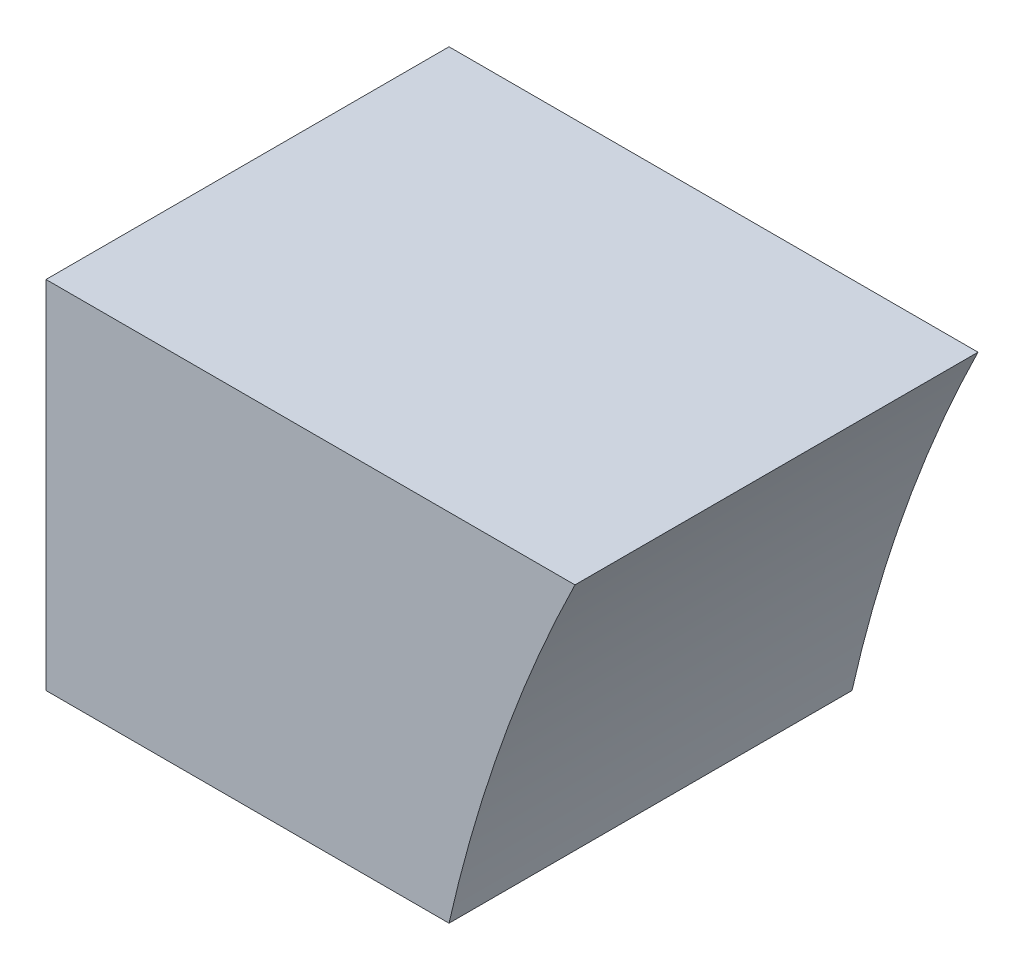
ISO-10303-21;
HEADER;
FILE_DESCRIPTION(('STEP AP214'),'2;1');
FILE_NAME('part.step','',(''),(''),'','','');
FILE_SCHEMA(('AUTOMOTIVE_DESIGN { 1 0 10303 214 1 1 1 1 }'));
ENDSEC;
DATA;
#1=APPLICATION_CONTEXT('core data for automotive mechanical design processes');
#2=APPLICATION_PROTOCOL_DEFINITION('international standard','automotive_design',2000,#1);
#3=PRODUCT_CONTEXT('',#1,'mechanical');
#4=PRODUCT('Part','Part','',(#3));
#5=PRODUCT_RELATED_PRODUCT_CATEGORY('part','',(#4));
#6=PRODUCT_DEFINITION_FORMATION('','',#4);
#7=PRODUCT_DEFINITION_CONTEXT('part definition',#1,'design');
#8=PRODUCT_DEFINITION('design','',#6,#7);
#9=PRODUCT_DEFINITION_SHAPE('','',#8);
#10=(LENGTH_UNIT() NAMED_UNIT(*) SI_UNIT(.MILLI.,.METRE.));
#11=(NAMED_UNIT(*) PLANE_ANGLE_UNIT() SI_UNIT($,.RADIAN.));
#12=(NAMED_UNIT(*) SI_UNIT($,.STERADIAN.) SOLID_ANGLE_UNIT());
#13=UNCERTAINTY_MEASURE_WITH_UNIT(LENGTH_MEASURE(1.E-05),#10,'distance_accuracy_value','');
#14=(GEOMETRIC_REPRESENTATION_CONTEXT(3) GLOBAL_UNCERTAINTY_ASSIGNED_CONTEXT((#13)) GLOBAL_UNIT_ASSIGNED_CONTEXT((#10,
#11,#12)) REPRESENTATION_CONTEXT('',''));
#15=CARTESIAN_POINT('',(0.,0.,0.));
#16=DIRECTION('',(0.,0.,1.));
#17=DIRECTION('',(1.,0.,0.));
#18=AXIS2_PLACEMENT_3D('',#15,#16,#17);
#19=CARTESIAN_POINT('',(-8112.,4992.,624.));
#20=DIRECTION('',(0.,0.,-1.));
#21=DIRECTION('',(-1.,0.,0.));
#22=AXIS2_PLACEMENT_3D('',#19,#20,#21);
#23=CYLINDRICAL_SURFACE('',#22,2496.);
#24=CARTESIAN_POINT('',(-8112.,4992.,0.));
#25=DIRECTION('',(0.,0.,1.));
#26=DIRECTION('',(1.,0.,0.));
#27=AXIS2_PLACEMENT_3D('',#24,#25,#26);
#28=CIRCLE('',#27,2496.);
#29=CARTESIAN_POINT('',(-10351.3593369533,6094.4,0.));
#30=VERTEX_POINT('',#29);
#31=CARTESIAN_POINT('',(-10546.3776535287,5543.2,0.));
#32=VERTEX_POINT('',#31);
#33=EDGE_CURVE('E100',#30,#32,#28,.T.);
#34=ORIENTED_EDGE('',*,*,#33,.F.);
#35=DIRECTION('',(0.,0.,-1.));
#36=VECTOR('',#35,1.);
#37=CARTESIAN_POINT('',(-10351.3593369533,6094.4,624.));
#38=LINE('',#37,#36);
#39=CARTESIAN_POINT('',(-10351.3593369533,6094.4,624.));
#40=VERTEX_POINT('',#39);
#41=EDGE_CURVE('E11',#40,#30,#38,.T.);
#42=ORIENTED_EDGE('',*,*,#41,.F.);
#43=CARTESIAN_POINT('',(-8112.,4992.,624.));
#44=DIRECTION('',(0.,0.,1.));
#45=DIRECTION('',(1.,0.,0.));
#46=AXIS2_PLACEMENT_3D('',#43,#44,#45);
#47=CIRCLE('',#46,2496.);
#48=CARTESIAN_POINT('',(-10546.3776535287,5543.2,624.));
#49=VERTEX_POINT('',#48);
#50=EDGE_CURVE('E93',#40,#49,#47,.T.);
#51=ORIENTED_EDGE('',*,*,#50,.T.);
#52=DIRECTION('',(0.,0.,-1.));
#53=VECTOR('',#52,1.);
#54=CARTESIAN_POINT('',(-10546.3776535287,5543.2,624.));
#55=LINE('',#54,#53);
#56=EDGE_CURVE('E75',#49,#32,#55,.T.);
#57=ORIENTED_EDGE('',*,*,#56,.T.);
#58=EDGE_LOOP('',(#34,#42,#51,#57));
#59=FACE_BOUND('',#58,.T.);
#60=ADVANCED_FACE('F37',(#59),#23,.F.);
#61=CARTESIAN_POINT('',(0.,6094.4,624.));
#62=DIRECTION('',(0.,1.,0.));
#63=DIRECTION('',(0.,0.,1.));
#64=AXIS2_PLACEMENT_3D('',#61,#62,#63);
#65=PLANE('',#64);
#66=DIRECTION('',(1.,0.,0.));
#67=VECTOR('',#66,1.);
#68=CARTESIAN_POINT('',(0.,6094.4,0.));
#69=LINE('',#68,#67);
#70=CARTESIAN_POINT('',(-11170.3776535287,6094.4,0.));
#71=VERTEX_POINT('',#70);
#72=EDGE_CURVE('E86',#71,#30,#69,.T.);
#73=ORIENTED_EDGE('',*,*,#72,.F.);
#74=DIRECTION('',(0.,0.,-1.));
#75=VECTOR('',#74,1.);
#76=CARTESIAN_POINT('',(-11170.3776535287,6094.4,624.));
#77=LINE('',#76,#75);
#78=CARTESIAN_POINT('',(-11170.3776535287,6094.4,624.));
#79=VERTEX_POINT('',#78);
#80=EDGE_CURVE('E45',#79,#71,#77,.T.);
#81=ORIENTED_EDGE('',*,*,#80,.F.);
#82=DIRECTION('',(1.,0.,0.));
#83=VECTOR('',#82,1.);
#84=CARTESIAN_POINT('',(0.,6094.4,624.));
#85=LINE('',#84,#83);
#86=EDGE_CURVE('E84',#79,#40,#85,.T.);
#87=ORIENTED_EDGE('',*,*,#86,.T.);
#88=ORIENTED_EDGE('',*,*,#41,.T.);
#89=EDGE_LOOP('',(#73,#81,#87,#88));
#90=FACE_BOUND('',#89,.T.);
#91=ADVANCED_FACE('F83',(#90),#65,.T.);
#92=CARTESIAN_POINT('',(-11170.3776535287,0.,624.));
#93=DIRECTION('',(-1.,0.,0.));
#94=DIRECTION('',(0.,0.,1.));
#95=AXIS2_PLACEMENT_3D('',#92,#93,#94);
#96=PLANE('',#95);
#97=DIRECTION('',(0.,1.,0.));
#98=VECTOR('',#97,1.);
#99=CARTESIAN_POINT('',(-11170.3776535287,0.,0.));
#100=LINE('',#99,#98);
#101=CARTESIAN_POINT('',(-11170.3776535287,5543.2,0.));
#102=VERTEX_POINT('',#101);
#103=EDGE_CURVE('E104',#102,#71,#100,.T.);
#104=ORIENTED_EDGE('',*,*,#103,.F.);
#105=DIRECTION('',(0.,0.,-1.));
#106=VECTOR('',#105,1.);
#107=CARTESIAN_POINT('',(-11170.3776535287,5543.2,624.));
#108=LINE('',#107,#106);
#109=CARTESIAN_POINT('',(-11170.3776535287,5543.2,624.));
#110=VERTEX_POINT('',#109);
#111=EDGE_CURVE('E68',#110,#102,#108,.T.);
#112=ORIENTED_EDGE('',*,*,#111,.F.);
#113=DIRECTION('',(0.,1.,0.));
#114=VECTOR('',#113,1.);
#115=CARTESIAN_POINT('',(-11170.3776535287,0.,624.));
#116=LINE('',#115,#114);
#117=EDGE_CURVE('E92',#110,#79,#116,.T.);
#118=ORIENTED_EDGE('',*,*,#117,.T.);
#119=ORIENTED_EDGE('',*,*,#80,.T.);
#120=EDGE_LOOP('',(#104,#112,#118,#119));
#121=FACE_BOUND('',#120,.T.);
#122=ADVANCED_FACE('F95',(#121),#96,.T.);
#123=CARTESIAN_POINT('',(0.,5543.2,624.));
#124=DIRECTION('',(0.,1.,0.));
#125=DIRECTION('',(0.,0.,1.));
#126=AXIS2_PLACEMENT_3D('',#123,#124,#125);
#127=PLANE('',#126);
#128=DIRECTION('',(1.,0.,0.));
#129=VECTOR('',#128,1.);
#130=CARTESIAN_POINT('',(0.,5543.2,0.));
#131=LINE('',#130,#129);
#132=EDGE_CURVE('E106',#102,#32,#131,.T.);
#133=ORIENTED_EDGE('',*,*,#132,.T.);
#134=ORIENTED_EDGE('',*,*,#56,.F.);
#135=DIRECTION('',(1.,0.,0.));
#136=VECTOR('',#135,1.);
#137=CARTESIAN_POINT('',(0.,5543.2,624.));
#138=LINE('',#137,#136);
#139=EDGE_CURVE('E53',#110,#49,#138,.T.);
#140=ORIENTED_EDGE('',*,*,#139,.F.);
#141=ORIENTED_EDGE('',*,*,#111,.T.);
#142=EDGE_LOOP('',(#133,#134,#140,#141));
#143=FACE_BOUND('',#142,.T.);
#144=ADVANCED_FACE('F116',(#143),#127,.F.);
#145=CARTESIAN_POINT('',(0.,0.,624.));
#146=DIRECTION('',(0.,0.,1.));
#147=DIRECTION('',(1.,0.,0.));
#148=AXIS2_PLACEMENT_3D('',#145,#146,#147);
#149=PLANE('',#148);
#150=ORIENTED_EDGE('',*,*,#50,.F.);
#151=ORIENTED_EDGE('',*,*,#86,.F.);
#152=ORIENTED_EDGE('',*,*,#117,.F.);
#153=ORIENTED_EDGE('',*,*,#139,.T.);
#154=EDGE_LOOP('',(#150,#151,#152,#153));
#155=FACE_BOUND('',#154,.T.);
#156=ADVANCED_FACE('F91',(#155),#149,.T.);
#157=CARTESIAN_POINT('',(0.,0.,0.));
#158=DIRECTION('',(0.,0.,1.));
#159=DIRECTION('',(1.,0.,0.));
#160=AXIS2_PLACEMENT_3D('',#157,#158,#159);
#161=PLANE('',#160);
#162=ORIENTED_EDGE('',*,*,#33,.T.);
#163=ORIENTED_EDGE('',*,*,#132,.F.);
#164=ORIENTED_EDGE('',*,*,#103,.T.);
#165=ORIENTED_EDGE('',*,*,#72,.T.);
#166=EDGE_LOOP('',(#162,#163,#164,#165));
#167=FACE_BOUND('',#166,.T.);
#168=ADVANCED_FACE('F121',(#167),#161,.F.);
#169=CLOSED_SHELL('',(#60,#91,#122,#144,#156,#168));
#170=MANIFOLD_SOLID_BREP('B2',#169);
#171=ADVANCED_BREP_SHAPE_REPRESENTATION('',(#18,#170),#14);
#172=SHAPE_DEFINITION_REPRESENTATION(#9,#171);
ENDSEC;
END-ISO-10303-21;
